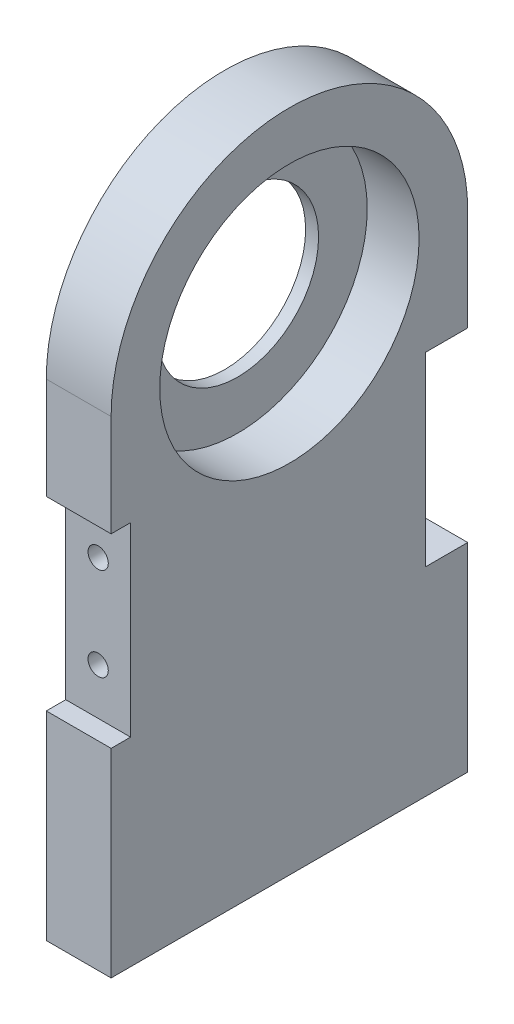
ISO-10303-21;
HEADER;
FILE_DESCRIPTION(('STEP AP214'),'2;1');
FILE_NAME('part.step','',(''),(''),'','','');
FILE_SCHEMA(('AUTOMOTIVE_DESIGN { 1 0 10303 214 1 1 1 1 }'));
ENDSEC;
DATA;
#1=APPLICATION_CONTEXT('core data for automotive mechanical design processes');
#2=APPLICATION_PROTOCOL_DEFINITION('international standard','automotive_design',2000,#1);
#3=PRODUCT_CONTEXT('',#1,'mechanical');
#4=PRODUCT('Part','Part','',(#3));
#5=PRODUCT_RELATED_PRODUCT_CATEGORY('part','',(#4));
#6=PRODUCT_DEFINITION_FORMATION('','',#4);
#7=PRODUCT_DEFINITION_CONTEXT('part definition',#1,'design');
#8=PRODUCT_DEFINITION('design','',#6,#7);
#9=PRODUCT_DEFINITION_SHAPE('','',#8);
#10=(LENGTH_UNIT() NAMED_UNIT(*) SI_UNIT(.MILLI.,.METRE.));
#11=(NAMED_UNIT(*) PLANE_ANGLE_UNIT() SI_UNIT($,.RADIAN.));
#12=(NAMED_UNIT(*) SI_UNIT($,.STERADIAN.) SOLID_ANGLE_UNIT());
#13=UNCERTAINTY_MEASURE_WITH_UNIT(LENGTH_MEASURE(1.E-05),#10,'distance_accuracy_value','');
#14=(GEOMETRIC_REPRESENTATION_CONTEXT(3) GLOBAL_UNCERTAINTY_ASSIGNED_CONTEXT((#13)) GLOBAL_UNIT_ASSIGNED_CONTEXT((#10,
#11,#12)) REPRESENTATION_CONTEXT('',''));
#15=CARTESIAN_POINT('',(0.,0.,0.));
#16=DIRECTION('',(0.,0.,1.));
#17=DIRECTION('',(1.,0.,0.));
#18=AXIS2_PLACEMENT_3D('',#15,#16,#17);
#19=CARTESIAN_POINT('',(20.,0.,-55.));
#20=DIRECTION('',(0.,0.,-1.));
#21=DIRECTION('',(0.,1.,0.));
#22=AXIS2_PLACEMENT_3D('',#19,#20,#21);
#23=PLANE('',#22);
#24=DIRECTION('',(1.,0.,0.));
#25=VECTOR('',#24,1.);
#26=CARTESIAN_POINT('',(0.,-13.65,-55.));
#27=LINE('',#26,#25);
#28=CARTESIAN_POINT('',(0.,-13.65,-55.));
#29=VERTEX_POINT('',#28);
#30=CARTESIAN_POINT('',(20.,-13.65,-55.));
#31=VERTEX_POINT('',#30);
#32=EDGE_CURVE('E246',#29,#31,#27,.T.);
#33=ORIENTED_EDGE('',*,*,#32,.T.);
#34=DIRECTION('',(0.,-1.,0.));
#35=VECTOR('',#34,1.);
#36=CARTESIAN_POINT('',(20.,0.,-55.));
#37=LINE('',#36,#35);
#38=CARTESIAN_POINT('',(20.,-75.,-55.));
#39=VERTEX_POINT('',#38);
#40=EDGE_CURVE('E324',#31,#39,#37,.T.);
#41=ORIENTED_EDGE('',*,*,#40,.T.);
#42=DIRECTION('',(-1.,0.,0.));
#43=VECTOR('',#42,1.);
#44=CARTESIAN_POINT('',(20.,-75.,-55.));
#45=LINE('',#44,#43);
#46=CARTESIAN_POINT('',(0.,-75.,-55.));
#47=VERTEX_POINT('',#46);
#48=EDGE_CURVE('E336',#39,#47,#45,.T.);
#49=ORIENTED_EDGE('',*,*,#48,.T.);
#50=DIRECTION('',(0.,-1.,0.));
#51=VECTOR('',#50,1.);
#52=CARTESIAN_POINT('',(0.,0.,-55.));
#53=LINE('',#52,#51);
#54=EDGE_CURVE('E314',#29,#47,#53,.T.);
#55=ORIENTED_EDGE('',*,*,#54,.F.);
#56=EDGE_LOOP('',(#33,#41,#49,#55));
#57=FACE_BOUND('',#56,.T.);
#58=ADVANCED_FACE('F42',(#57),#23,.T.);
#59=CARTESIAN_POINT('',(20.,0.,55.));
#60=DIRECTION('',(0.,0.,-1.));
#61=DIRECTION('',(0.,1.,0.));
#62=AXIS2_PLACEMENT_3D('',#59,#60,#61);
#63=PLANE('',#62);
#64=DIRECTION('',(0.,-1.,0.));
#65=VECTOR('',#64,1.);
#66=CARTESIAN_POINT('',(20.,0.,55.));
#67=LINE('',#66,#65);
#68=CARTESIAN_POINT('',(20.,-13.65,55.));
#69=VERTEX_POINT('',#68);
#70=CARTESIAN_POINT('',(20.,-75.,55.));
#71=VERTEX_POINT('',#70);
#72=EDGE_CURVE('E327',#69,#71,#67,.T.);
#73=ORIENTED_EDGE('',*,*,#72,.F.);
#74=DIRECTION('',(1.,0.,0.));
#75=VECTOR('',#74,1.);
#76=CARTESIAN_POINT('',(0.,-13.65,55.));
#77=LINE('',#76,#75);
#78=CARTESIAN_POINT('',(0.,-13.65,55.));
#79=VERTEX_POINT('',#78);
#80=EDGE_CURVE('E222',#79,#69,#77,.T.);
#81=ORIENTED_EDGE('',*,*,#80,.F.);
#82=DIRECTION('',(0.,-1.,0.));
#83=VECTOR('',#82,1.);
#84=CARTESIAN_POINT('',(0.,0.,55.));
#85=LINE('',#84,#83);
#86=CARTESIAN_POINT('',(0.,-75.,55.));
#87=VERTEX_POINT('',#86);
#88=EDGE_CURVE('E344',#79,#87,#85,.T.);
#89=ORIENTED_EDGE('',*,*,#88,.T.);
#90=DIRECTION('',(-1.,0.,0.));
#91=VECTOR('',#90,1.);
#92=CARTESIAN_POINT('',(20.,-75.,55.));
#93=LINE('',#92,#91);
#94=EDGE_CURVE('E356',#71,#87,#93,.T.);
#95=ORIENTED_EDGE('',*,*,#94,.F.);
#96=EDGE_LOOP('',(#73,#81,#89,#95));
#97=FACE_BOUND('',#96,.T.);
#98=ADVANCED_FACE('F426',(#97),#63,.F.);
#99=DIRECTION('',(1.,0.,0.));
#100=VECTOR('',#99,1.);
#101=CARTESIAN_POINT('',(0.,43.65,-55.));
#102=LINE('',#101,#100);
#103=CARTESIAN_POINT('',(0.,43.65,-55.));
#104=VERTEX_POINT('',#103);
#105=CARTESIAN_POINT('',(20.,43.65,-55.));
#106=VERTEX_POINT('',#105);
#107=EDGE_CURVE('E261',#104,#106,#102,.T.);
#108=ORIENTED_EDGE('',*,*,#107,.F.);
#109=CARTESIAN_POINT('',(0.,75.,-55.));
#110=VERTEX_POINT('',#109);
#111=EDGE_CURVE('E337',#110,#104,#53,.T.);
#112=ORIENTED_EDGE('',*,*,#111,.F.);
#113=DIRECTION('',(-1.,0.,0.));
#114=VECTOR('',#113,1.);
#115=CARTESIAN_POINT('',(20.,75.,-55.));
#116=LINE('',#115,#114);
#117=CARTESIAN_POINT('',(20.,75.,-55.));
#118=VERTEX_POINT('',#117);
#119=EDGE_CURVE('E11',#118,#110,#116,.T.);
#120=ORIENTED_EDGE('',*,*,#119,.F.);
#121=EDGE_CURVE('E319',#118,#106,#37,.T.);
#122=ORIENTED_EDGE('',*,*,#121,.T.);
#123=EDGE_LOOP('',(#108,#112,#120,#122));
#124=FACE_BOUND('',#123,.T.);
#125=ADVANCED_FACE('F44',(#124),#23,.T.);
#126=CARTESIAN_POINT('',(20.,75.,0.));
#127=DIRECTION('',(-1.,0.,0.));
#128=DIRECTION('',(0.,0.,1.));
#129=AXIS2_PLACEMENT_3D('',#126,#127,#128);
#130=CYLINDRICAL_SURFACE('',#129,55.);
#131=CARTESIAN_POINT('',(0.,75.,0.));
#132=DIRECTION('',(1.,0.,0.));
#133=DIRECTION('',(0.,0.,-1.));
#134=AXIS2_PLACEMENT_3D('',#131,#132,#133);
#135=CIRCLE('',#134,55.);
#136=CARTESIAN_POINT('',(0.,75.,55.));
#137=VERTEX_POINT('',#136);
#138=EDGE_CURVE('E341',#110,#137,#135,.T.);
#139=ORIENTED_EDGE('',*,*,#138,.T.);
#140=DIRECTION('',(-1.,0.,0.));
#141=VECTOR('',#140,1.);
#142=CARTESIAN_POINT('',(20.,75.,55.));
#143=LINE('',#142,#141);
#144=CARTESIAN_POINT('',(20.,75.,55.));
#145=VERTEX_POINT('',#144);
#146=EDGE_CURVE('E52',#145,#137,#143,.T.);
#147=ORIENTED_EDGE('',*,*,#146,.F.);
#148=CARTESIAN_POINT('',(20.,75.,0.));
#149=DIRECTION('',(1.,0.,0.));
#150=DIRECTION('',(0.,0.,-1.));
#151=AXIS2_PLACEMENT_3D('',#148,#149,#150);
#152=CIRCLE('',#151,55.);
#153=EDGE_CURVE('E323',#118,#145,#152,.T.);
#154=ORIENTED_EDGE('',*,*,#153,.F.);
#155=ORIENTED_EDGE('',*,*,#119,.T.);
#156=EDGE_LOOP('',(#139,#147,#154,#155));
#157=FACE_BOUND('',#156,.T.);
#158=ADVANCED_FACE('F387',(#157),#130,.T.);
#159=CARTESIAN_POINT('',(0.,43.65,55.));
#160=VERTEX_POINT('',#159);
#161=EDGE_CURVE('E345',#137,#160,#85,.T.);
#162=ORIENTED_EDGE('',*,*,#161,.T.);
#163=DIRECTION('',(1.,0.,0.));
#164=VECTOR('',#163,1.);
#165=CARTESIAN_POINT('',(0.,43.65,55.));
#166=LINE('',#165,#164);
#167=CARTESIAN_POINT('',(20.,43.65,55.));
#168=VERTEX_POINT('',#167);
#169=EDGE_CURVE('E226',#160,#168,#166,.T.);
#170=ORIENTED_EDGE('',*,*,#169,.T.);
#171=EDGE_CURVE('E328',#145,#168,#67,.T.);
#172=ORIENTED_EDGE('',*,*,#171,.F.);
#173=ORIENTED_EDGE('',*,*,#146,.T.);
#174=EDGE_LOOP('',(#162,#170,#172,#173));
#175=FACE_BOUND('',#174,.T.);
#176=ADVANCED_FACE('F366',(#175),#63,.F.);
#177=CARTESIAN_POINT('',(20.,-75.,0.));
#178=DIRECTION('',(0.,-1.,0.));
#179=DIRECTION('',(0.,0.,-1.));
#180=AXIS2_PLACEMENT_3D('',#177,#178,#179);
#181=PLANE('',#180);
#182=CARTESIAN_POINT('',(10.,-75.,36.6666666666666));
#183=DIRECTION('',(0.,-1.,0.));
#184=DIRECTION('',(0.,0.,-1.));
#185=AXIS2_PLACEMENT_3D('',#182,#183,#184);
#186=CIRCLE('',#185,2.49999999999999);
#187=CARTESIAN_POINT('',(10.,-75.,34.1666666666667));
#188=VERTEX_POINT('',#187);
#189=EDGE_CURVE('E225',#188,#188,#186,.T.);
#190=ORIENTED_EDGE('',*,*,#189,.F.);
#191=EDGE_LOOP('',(#190));
#192=FACE_BOUND('',#191,.T.);
#193=CARTESIAN_POINT('',(10.,-75.,18.3333333333333));
#194=DIRECTION('',(0.,-1.,0.));
#195=DIRECTION('',(0.,0.,-1.));
#196=AXIS2_PLACEMENT_3D('',#193,#194,#195);
#197=CIRCLE('',#196,2.49999999999999);
#198=CARTESIAN_POINT('',(10.,-75.,15.8333333333333));
#199=VERTEX_POINT('',#198);
#200=EDGE_CURVE('E274',#199,#199,#197,.T.);
#201=ORIENTED_EDGE('',*,*,#200,.F.);
#202=EDGE_LOOP('',(#201));
#203=FACE_BOUND('',#202,.T.);
#204=CARTESIAN_POINT('',(10.,-75.,0.));
#205=DIRECTION('',(0.,-1.,0.));
#206=DIRECTION('',(0.,0.,-1.));
#207=AXIS2_PLACEMENT_3D('',#204,#205,#206);
#208=CIRCLE('',#207,2.49999999999999);
#209=CARTESIAN_POINT('',(10.,-75.,-2.50000000000001));
#210=VERTEX_POINT('',#209);
#211=EDGE_CURVE('E282',#210,#210,#208,.T.);
#212=ORIENTED_EDGE('',*,*,#211,.F.);
#213=EDGE_LOOP('',(#212));
#214=FACE_BOUND('',#213,.T.);
#215=CARTESIAN_POINT('',(10.,-75.,-18.3333333333334));
#216=DIRECTION('',(0.,-1.,0.));
#217=DIRECTION('',(0.,0.,-1.));
#218=AXIS2_PLACEMENT_3D('',#215,#216,#217);
#219=CIRCLE('',#218,2.49999999999999);
#220=CARTESIAN_POINT('',(10.,-75.,-20.8333333333333));
#221=VERTEX_POINT('',#220);
#222=EDGE_CURVE('E290',#221,#221,#219,.T.);
#223=ORIENTED_EDGE('',*,*,#222,.F.);
#224=EDGE_LOOP('',(#223));
#225=FACE_BOUND('',#224,.T.);
#226=CARTESIAN_POINT('',(10.,-75.,-36.6666666666667));
#227=DIRECTION('',(0.,-1.,0.));
#228=DIRECTION('',(0.,0.,-1.));
#229=AXIS2_PLACEMENT_3D('',#226,#227,#228);
#230=CIRCLE('',#229,2.49999999999999);
#231=CARTESIAN_POINT('',(10.,-75.,-39.1666666666667));
#232=VERTEX_POINT('',#231);
#233=EDGE_CURVE('E298',#232,#232,#230,.T.);
#234=ORIENTED_EDGE('',*,*,#233,.F.);
#235=EDGE_LOOP('',(#234));
#236=FACE_BOUND('',#235,.T.);
#237=DIRECTION('',(0.,0.,1.));
#238=VECTOR('',#237,1.);
#239=CARTESIAN_POINT('',(0.,-75.,0.));
#240=LINE('',#239,#238);
#241=EDGE_CURVE('E349',#47,#87,#240,.T.);
#242=ORIENTED_EDGE('',*,*,#241,.F.);
#243=ORIENTED_EDGE('',*,*,#48,.F.);
#244=DIRECTION('',(0.,0.,1.));
#245=VECTOR('',#244,1.);
#246=CARTESIAN_POINT('',(20.,-75.,0.));
#247=LINE('',#246,#245);
#248=EDGE_CURVE('E332',#39,#71,#247,.T.);
#249=ORIENTED_EDGE('',*,*,#248,.T.);
#250=ORIENTED_EDGE('',*,*,#94,.T.);
#251=EDGE_LOOP('',(#242,#243,#249,#250));
#252=FACE_BOUND('',#251,.T.);
#253=ADVANCED_FACE('F439',(#192,#203,#214,#225,#236,#252),#181,.T.);
#254=CARTESIAN_POINT('',(20.,0.,0.));
#255=DIRECTION('',(1.,0.,0.));
#256=DIRECTION('',(0.,0.,-1.));
#257=AXIS2_PLACEMENT_3D('',#254,#255,#256);
#258=PLANE('',#257);
#259=DIRECTION('',(0.,0.,-1.));
#260=VECTOR('',#259,1.);
#261=CARTESIAN_POINT('',(20.,-13.65,49.));
#262=LINE('',#261,#260);
#263=CARTESIAN_POINT('',(20.,-13.65,49.));
#264=VERTEX_POINT('',#263);
#265=EDGE_CURVE('E211',#69,#264,#262,.T.);
#266=ORIENTED_EDGE('',*,*,#265,.F.);
#267=ORIENTED_EDGE('',*,*,#72,.T.);
#268=ORIENTED_EDGE('',*,*,#248,.F.);
#269=ORIENTED_EDGE('',*,*,#40,.F.);
#270=DIRECTION('',(0.,0.,-1.));
#271=VECTOR('',#270,1.);
#272=CARTESIAN_POINT('',(20.,-13.65,-42.));
#273=LINE('',#272,#271);
#274=CARTESIAN_POINT('',(20.,-13.65,-42.));
#275=VERTEX_POINT('',#274);
#276=EDGE_CURVE('E198',#275,#31,#273,.T.);
#277=ORIENTED_EDGE('',*,*,#276,.F.);
#278=DIRECTION('',(0.,-1.,0.));
#279=VECTOR('',#278,1.);
#280=CARTESIAN_POINT('',(20.,43.65,-42.));
#281=LINE('',#280,#279);
#282=CARTESIAN_POINT('',(20.,43.65,-42.));
#283=VERTEX_POINT('',#282);
#284=EDGE_CURVE('E240',#283,#275,#281,.T.);
#285=ORIENTED_EDGE('',*,*,#284,.F.);
#286=DIRECTION('',(0.,0.,1.));
#287=VECTOR('',#286,1.);
#288=CARTESIAN_POINT('',(20.,43.65,-55.));
#289=LINE('',#288,#287);
#290=EDGE_CURVE('E249',#106,#283,#289,.T.);
#291=ORIENTED_EDGE('',*,*,#290,.F.);
#292=ORIENTED_EDGE('',*,*,#121,.F.);
#293=ORIENTED_EDGE('',*,*,#153,.T.);
#294=ORIENTED_EDGE('',*,*,#171,.T.);
#295=DIRECTION('',(0.,0.,1.));
#296=VECTOR('',#295,1.);
#297=CARTESIAN_POINT('',(20.,43.65,55.));
#298=LINE('',#297,#296);
#299=CARTESIAN_POINT('',(20.,43.65,49.));
#300=VERTEX_POINT('',#299);
#301=EDGE_CURVE('E204',#300,#168,#298,.T.);
#302=ORIENTED_EDGE('',*,*,#301,.F.);
#303=DIRECTION('',(0.,1.,0.));
#304=VECTOR('',#303,1.);
#305=CARTESIAN_POINT('',(20.,43.65,49.));
#306=LINE('',#305,#304);
#307=EDGE_CURVE('E215',#264,#300,#306,.T.);
#308=ORIENTED_EDGE('',*,*,#307,.F.);
#309=EDGE_LOOP('',(#266,#267,#268,#269,#277,#285,#291,#292,#293,#294,#302,#308));
#310=FACE_BOUND('',#309,.T.);
#311=CARTESIAN_POINT('',(20.,75.,0.));
#312=DIRECTION('',(1.,0.,0.));
#313=DIRECTION('',(0.,0.,-1.));
#314=AXIS2_PLACEMENT_3D('',#311,#312,#313);
#315=CIRCLE('',#314,40.);
#316=CARTESIAN_POINT('',(20.,75.,-40.));
#317=VERTEX_POINT('',#316);
#318=EDGE_CURVE('E315',#317,#317,#315,.T.);
#319=ORIENTED_EDGE('',*,*,#318,.F.);
#320=EDGE_LOOP('',(#319));
#321=FACE_BOUND('',#320,.T.);
#322=ADVANCED_FACE('F383',(#310,#321),#258,.T.);
#323=CARTESIAN_POINT('',(0.,0.,0.));
#324=DIRECTION('',(1.,0.,0.));
#325=DIRECTION('',(0.,0.,-1.));
#326=AXIS2_PLACEMENT_3D('',#323,#324,#325);
#327=PLANE('',#326);
#328=ORIENTED_EDGE('',*,*,#88,.F.);
#329=DIRECTION('',(0.,0.,-1.));
#330=VECTOR('',#329,1.);
#331=CARTESIAN_POINT('',(0.,-13.65,49.));
#332=LINE('',#331,#330);
#333=CARTESIAN_POINT('',(0.,-13.65,49.));
#334=VERTEX_POINT('',#333);
#335=EDGE_CURVE('E199',#79,#334,#332,.T.);
#336=ORIENTED_EDGE('',*,*,#335,.T.);
#337=DIRECTION('',(0.,1.,0.));
#338=VECTOR('',#337,1.);
#339=CARTESIAN_POINT('',(0.,43.65,49.));
#340=LINE('',#339,#338);
#341=CARTESIAN_POINT('',(0.,43.65,49.));
#342=VERTEX_POINT('',#341);
#343=EDGE_CURVE('E203',#334,#342,#340,.T.);
#344=ORIENTED_EDGE('',*,*,#343,.T.);
#345=DIRECTION('',(0.,0.,1.));
#346=VECTOR('',#345,1.);
#347=CARTESIAN_POINT('',(0.,43.65,55.));
#348=LINE('',#347,#346);
#349=EDGE_CURVE('E59',#342,#160,#348,.T.);
#350=ORIENTED_EDGE('',*,*,#349,.T.);
#351=ORIENTED_EDGE('',*,*,#161,.F.);
#352=ORIENTED_EDGE('',*,*,#138,.F.);
#353=ORIENTED_EDGE('',*,*,#111,.T.);
#354=DIRECTION('',(0.,0.,1.));
#355=VECTOR('',#354,1.);
#356=CARTESIAN_POINT('',(0.,43.65,-55.));
#357=LINE('',#356,#355);
#358=CARTESIAN_POINT('',(0.,43.65,-42.));
#359=VERTEX_POINT('',#358);
#360=EDGE_CURVE('E239',#104,#359,#357,.T.);
#361=ORIENTED_EDGE('',*,*,#360,.T.);
#362=DIRECTION('',(0.,-1.,0.));
#363=VECTOR('',#362,1.);
#364=CARTESIAN_POINT('',(0.,43.65,-42.));
#365=LINE('',#364,#363);
#366=CARTESIAN_POINT('',(0.,-13.65,-42.));
#367=VERTEX_POINT('',#366);
#368=EDGE_CURVE('E67',#359,#367,#365,.T.);
#369=ORIENTED_EDGE('',*,*,#368,.T.);
#370=DIRECTION('',(0.,0.,-1.));
#371=VECTOR('',#370,1.);
#372=CARTESIAN_POINT('',(0.,-13.65,-42.));
#373=LINE('',#372,#371);
#374=EDGE_CURVE('E235',#367,#29,#373,.T.);
#375=ORIENTED_EDGE('',*,*,#374,.T.);
#376=ORIENTED_EDGE('',*,*,#54,.T.);
#377=ORIENTED_EDGE('',*,*,#241,.T.);
#378=EDGE_LOOP('',(#328,#336,#344,#350,#351,#352,#353,#361,#369,#375,#376,#377));
#379=FACE_BOUND('',#378,.T.);
#380=CARTESIAN_POINT('',(0.,75.,0.));
#381=DIRECTION('',(1.,0.,0.));
#382=DIRECTION('',(0.,0.,-1.));
#383=AXIS2_PLACEMENT_3D('',#380,#381,#382);
#384=CIRCLE('',#383,25.);
#385=CARTESIAN_POINT('',(0.,75.,-25.));
#386=VERTEX_POINT('',#385);
#387=EDGE_CURVE('E46',#386,#386,#384,.T.);
#388=ORIENTED_EDGE('',*,*,#387,.T.);
#389=EDGE_LOOP('',(#388));
#390=FACE_BOUND('',#389,.T.);
#391=ADVANCED_FACE('F372',(#379,#390),#327,.F.);
#392=CARTESIAN_POINT('',(4.,75.,0.));
#393=DIRECTION('',(1.,0.,0.));
#394=DIRECTION('',(0.,0.,-1.));
#395=AXIS2_PLACEMENT_3D('',#392,#393,#394);
#396=CYLINDRICAL_SURFACE('',#395,40.);
#397=CARTESIAN_POINT('',(4.,75.,0.));
#398=DIRECTION('',(1.,0.,0.));
#399=DIRECTION('',(0.,0.,-1.));
#400=AXIS2_PLACEMENT_3D('',#397,#398,#399);
#401=CIRCLE('',#400,40.);
#402=CARTESIAN_POINT('',(4.,75.,-40.));
#403=VERTEX_POINT('',#402);
#404=EDGE_CURVE('E310',#403,#403,#401,.T.);
#405=ORIENTED_EDGE('',*,*,#404,.F.);
#406=EDGE_LOOP('',(#405));
#407=FACE_BOUND('',#406,.T.);
#408=ORIENTED_EDGE('',*,*,#318,.T.);
#409=EDGE_LOOP('',(#408));
#410=FACE_BOUND('',#409,.T.);
#411=ADVANCED_FACE('F422',(#407,#410),#396,.F.);
#412=CARTESIAN_POINT('',(4.,75.,0.));
#413=DIRECTION('',(1.,0.,0.));
#414=DIRECTION('',(0.,0.,-1.));
#415=AXIS2_PLACEMENT_3D('',#412,#413,#414);
#416=PLANE('',#415);
#417=CARTESIAN_POINT('',(4.,75.,0.));
#418=DIRECTION('',(1.,0.,0.));
#419=DIRECTION('',(0.,0.,-1.));
#420=AXIS2_PLACEMENT_3D('',#417,#418,#419);
#421=CIRCLE('',#420,25.);
#422=CARTESIAN_POINT('',(4.,75.,-25.));
#423=VERTEX_POINT('',#422);
#424=EDGE_CURVE('E306',#423,#423,#421,.T.);
#425=ORIENTED_EDGE('',*,*,#424,.F.);
#426=EDGE_LOOP('',(#425));
#427=FACE_BOUND('',#426,.T.);
#428=ORIENTED_EDGE('',*,*,#404,.T.);
#429=EDGE_LOOP('',(#428));
#430=FACE_BOUND('',#429,.T.);
#431=ADVANCED_FACE('F412',(#427,#430),#416,.T.);
#432=CARTESIAN_POINT('',(-7.1125,75.,0.));
#433=DIRECTION('',(1.,0.,0.));
#434=DIRECTION('',(0.,0.,-1.));
#435=AXIS2_PLACEMENT_3D('',#432,#433,#434);
#436=CYLINDRICAL_SURFACE('',#435,25.);
#437=ORIENTED_EDGE('',*,*,#424,.T.);
#438=EDGE_LOOP('',(#437));
#439=FACE_BOUND('',#438,.T.);
#440=ORIENTED_EDGE('',*,*,#387,.F.);
#441=EDGE_LOOP('',(#440));
#442=FACE_BOUND('',#441,.T.);
#443=ADVANCED_FACE('F409',(#439,#442),#436,.F.);
#444=CARTESIAN_POINT('',(10.,-35.,-36.6666666666667));
#445=DIRECTION('',(0.,-1.,0.));
#446=DIRECTION('',(0.,0.,-1.));
#447=AXIS2_PLACEMENT_3D('',#444,#445,#446);
#448=CONICAL_SURFACE('',#447,2.5,1.02974425867665);
#449=CARTESIAN_POINT('',(9.99999999999999,-33.4978484524311,-36.6666666666667));
#450=VERTEX_POINT('',#449);
#451=VERTEX_LOOP('',#450);
#452=FACE_BOUND('',#451,.T.);
#453=CARTESIAN_POINT('',(10.,-35.,-36.6666666666667));
#454=DIRECTION('',(0.,-1.,0.));
#455=DIRECTION('',(0.,0.,-1.));
#456=AXIS2_PLACEMENT_3D('',#453,#454,#455);
#457=CIRCLE('',#456,2.5);
#458=CARTESIAN_POINT('',(10.,-35.,-39.1666666666667));
#459=VERTEX_POINT('',#458);
#460=EDGE_CURVE('E302',#459,#459,#457,.T.);
#461=ORIENTED_EDGE('',*,*,#460,.T.);
#462=EDGE_LOOP('',(#461));
#463=FACE_BOUND('',#462,.T.);
#464=ADVANCED_FACE('F411',(#452,#463),#448,.F.);
#465=CARTESIAN_POINT('',(10.,-75.,-36.6666666666667));
#466=DIRECTION('',(0.,-1.,0.));
#467=DIRECTION('',(0.,0.,-1.));
#468=AXIS2_PLACEMENT_3D('',#465,#466,#467);
#469=CYLINDRICAL_SURFACE('',#468,2.49999999999999);
#470=ORIENTED_EDGE('',*,*,#460,.F.);
#471=EDGE_LOOP('',(#470));
#472=FACE_BOUND('',#471,.T.);
#473=ORIENTED_EDGE('',*,*,#233,.T.);
#474=EDGE_LOOP('',(#473));
#475=FACE_BOUND('',#474,.T.);
#476=ADVANCED_FACE('F419',(#472,#475),#469,.F.);
#477=CARTESIAN_POINT('',(10.,-35.,-18.3333333333334));
#478=DIRECTION('',(0.,-1.,0.));
#479=DIRECTION('',(0.,0.,-1.));
#480=AXIS2_PLACEMENT_3D('',#477,#478,#479);
#481=CONICAL_SURFACE('',#480,2.5,1.02974425867665);
#482=CARTESIAN_POINT('',(9.99999999999999,-33.4978484524311,-18.3333333333334));
#483=VERTEX_POINT('',#482);
#484=VERTEX_LOOP('',#483);
#485=FACE_BOUND('',#484,.T.);
#486=CARTESIAN_POINT('',(10.,-35.,-18.3333333333334));
#487=DIRECTION('',(0.,-1.,0.));
#488=DIRECTION('',(0.,0.,-1.));
#489=AXIS2_PLACEMENT_3D('',#486,#487,#488);
#490=CIRCLE('',#489,2.5);
#491=CARTESIAN_POINT('',(10.,-35.,-20.8333333333333));
#492=VERTEX_POINT('',#491);
#493=EDGE_CURVE('E294',#492,#492,#490,.T.);
#494=ORIENTED_EDGE('',*,*,#493,.T.);
#495=EDGE_LOOP('',(#494));
#496=FACE_BOUND('',#495,.T.);
#497=ADVANCED_FACE('F489',(#485,#496),#481,.F.);
#498=CARTESIAN_POINT('',(10.,-75.,-18.3333333333334));
#499=DIRECTION('',(0.,-1.,0.));
#500=DIRECTION('',(0.,0.,-1.));
#501=AXIS2_PLACEMENT_3D('',#498,#499,#500);
#502=CYLINDRICAL_SURFACE('',#501,2.49999999999999);
#503=ORIENTED_EDGE('',*,*,#493,.F.);
#504=EDGE_LOOP('',(#503));
#505=FACE_BOUND('',#504,.T.);
#506=ORIENTED_EDGE('',*,*,#222,.T.);
#507=EDGE_LOOP('',(#506));
#508=FACE_BOUND('',#507,.T.);
#509=ADVANCED_FACE('F499',(#505,#508),#502,.F.);
#510=CARTESIAN_POINT('',(10.,-35.,0.));
#511=DIRECTION('',(0.,-1.,0.));
#512=DIRECTION('',(0.,0.,-1.));
#513=AXIS2_PLACEMENT_3D('',#510,#511,#512);
#514=CONICAL_SURFACE('',#513,2.5,1.02974425867665);
#515=CARTESIAN_POINT('',(9.99999999999999,-33.4978484524311,0.));
#516=VERTEX_POINT('',#515);
#517=VERTEX_LOOP('',#516);
#518=FACE_BOUND('',#517,.T.);
#519=CARTESIAN_POINT('',(10.,-35.,0.));
#520=DIRECTION('',(0.,-1.,0.));
#521=DIRECTION('',(0.,0.,-1.));
#522=AXIS2_PLACEMENT_3D('',#519,#520,#521);
#523=CIRCLE('',#522,2.5);
#524=CARTESIAN_POINT('',(10.,-35.,-2.50000000000002));
#525=VERTEX_POINT('',#524);
#526=EDGE_CURVE('E286',#525,#525,#523,.T.);
#527=ORIENTED_EDGE('',*,*,#526,.T.);
#528=EDGE_LOOP('',(#527));
#529=FACE_BOUND('',#528,.T.);
#530=ADVANCED_FACE('F509',(#518,#529),#514,.F.);
#531=CARTESIAN_POINT('',(10.,-75.,0.));
#532=DIRECTION('',(0.,-1.,0.));
#533=DIRECTION('',(0.,0.,-1.));
#534=AXIS2_PLACEMENT_3D('',#531,#532,#533);
#535=CYLINDRICAL_SURFACE('',#534,2.49999999999999);
#536=ORIENTED_EDGE('',*,*,#526,.F.);
#537=EDGE_LOOP('',(#536));
#538=FACE_BOUND('',#537,.T.);
#539=ORIENTED_EDGE('',*,*,#211,.T.);
#540=EDGE_LOOP('',(#539));
#541=FACE_BOUND('',#540,.T.);
#542=ADVANCED_FACE('F519',(#538,#541),#535,.F.);
#543=CARTESIAN_POINT('',(10.,-35.,18.3333333333333));
#544=DIRECTION('',(0.,-1.,0.));
#545=DIRECTION('',(0.,0.,-1.));
#546=AXIS2_PLACEMENT_3D('',#543,#544,#545);
#547=CONICAL_SURFACE('',#546,2.5,1.02974425867665);
#548=CARTESIAN_POINT('',(9.99999999999999,-33.4978484524311,18.3333333333333));
#549=VERTEX_POINT('',#548);
#550=VERTEX_LOOP('',#549);
#551=FACE_BOUND('',#550,.T.);
#552=CARTESIAN_POINT('',(10.,-35.,18.3333333333333));
#553=DIRECTION('',(0.,-1.,0.));
#554=DIRECTION('',(0.,0.,-1.));
#555=AXIS2_PLACEMENT_3D('',#552,#553,#554);
#556=CIRCLE('',#555,2.5);
#557=CARTESIAN_POINT('',(10.,-35.,15.8333333333333));
#558=VERTEX_POINT('',#557);
#559=EDGE_CURVE('E278',#558,#558,#556,.T.);
#560=ORIENTED_EDGE('',*,*,#559,.T.);
#561=EDGE_LOOP('',(#560));
#562=FACE_BOUND('',#561,.T.);
#563=ADVANCED_FACE('F529',(#551,#562),#547,.F.);
#564=CARTESIAN_POINT('',(10.,-75.,18.3333333333333));
#565=DIRECTION('',(0.,-1.,0.));
#566=DIRECTION('',(0.,0.,-1.));
#567=AXIS2_PLACEMENT_3D('',#564,#565,#566);
#568=CYLINDRICAL_SURFACE('',#567,2.49999999999999);
#569=ORIENTED_EDGE('',*,*,#559,.F.);
#570=EDGE_LOOP('',(#569));
#571=FACE_BOUND('',#570,.T.);
#572=ORIENTED_EDGE('',*,*,#200,.T.);
#573=EDGE_LOOP('',(#572));
#574=FACE_BOUND('',#573,.T.);
#575=ADVANCED_FACE('F539',(#571,#574),#568,.F.);
#576=CARTESIAN_POINT('',(10.,-35.,36.6666666666666));
#577=DIRECTION('',(0.,-1.,0.));
#578=DIRECTION('',(0.,0.,-1.));
#579=AXIS2_PLACEMENT_3D('',#576,#577,#578);
#580=CONICAL_SURFACE('',#579,2.5,1.02974425867665);
#581=CARTESIAN_POINT('',(9.99999999999999,-33.4978484524311,36.6666666666666));
#582=VERTEX_POINT('',#581);
#583=VERTEX_LOOP('',#582);
#584=FACE_BOUND('',#583,.T.);
#585=CARTESIAN_POINT('',(10.,-35.,36.6666666666666));
#586=DIRECTION('',(0.,-1.,0.));
#587=DIRECTION('',(0.,0.,-1.));
#588=AXIS2_PLACEMENT_3D('',#585,#586,#587);
#589=CIRCLE('',#588,2.5);
#590=CARTESIAN_POINT('',(10.,-35.,34.1666666666667));
#591=VERTEX_POINT('',#590);
#592=EDGE_CURVE('E270',#591,#591,#589,.T.);
#593=ORIENTED_EDGE('',*,*,#592,.T.);
#594=EDGE_LOOP('',(#593));
#595=FACE_BOUND('',#594,.T.);
#596=ADVANCED_FACE('F549',(#584,#595),#580,.F.);
#597=CARTESIAN_POINT('',(10.,-75.,36.6666666666666));
#598=DIRECTION('',(0.,-1.,0.));
#599=DIRECTION('',(0.,0.,-1.));
#600=AXIS2_PLACEMENT_3D('',#597,#598,#599);
#601=CYLINDRICAL_SURFACE('',#600,2.49999999999999);
#602=ORIENTED_EDGE('',*,*,#592,.F.);
#603=EDGE_LOOP('',(#602));
#604=FACE_BOUND('',#603,.T.);
#605=ORIENTED_EDGE('',*,*,#189,.T.);
#606=EDGE_LOOP('',(#605));
#607=FACE_BOUND('',#606,.T.);
#608=ADVANCED_FACE('F559',(#604,#607),#601,.F.);
#609=CARTESIAN_POINT('',(0.,-13.65,-42.));
#610=DIRECTION('',(0.,-1.,0.));
#611=DIRECTION('',(0.,0.,-1.));
#612=AXIS2_PLACEMENT_3D('',#609,#610,#611);
#613=PLANE('',#612);
#614=ORIENTED_EDGE('',*,*,#276,.T.);
#615=ORIENTED_EDGE('',*,*,#32,.F.);
#616=ORIENTED_EDGE('',*,*,#374,.F.);
#617=DIRECTION('',(1.,0.,0.));
#618=VECTOR('',#617,1.);
#619=CARTESIAN_POINT('',(0.,-13.65,-42.));
#620=LINE('',#619,#618);
#621=EDGE_CURVE('E216',#367,#275,#620,.T.);
#622=ORIENTED_EDGE('',*,*,#621,.T.);
#623=EDGE_LOOP('',(#614,#615,#616,#622));
#624=FACE_BOUND('',#623,.T.);
#625=ADVANCED_FACE('F399',(#624),#613,.F.);
#626=CARTESIAN_POINT('',(0.,43.65,-42.));
#627=DIRECTION('',(0.,0.,1.));
#628=DIRECTION('',(1.,0.,0.));
#629=AXIS2_PLACEMENT_3D('',#626,#627,#628);
#630=PLANE('',#629);
#631=CARTESIAN_POINT('',(10.,29.325,-42.));
#632=DIRECTION('',(0.,0.,-1.));
#633=DIRECTION('',(-1.,0.,0.));
#634=AXIS2_PLACEMENT_3D('',#631,#632,#633);
#635=CIRCLE('',#634,3.12499999999999);
#636=CARTESIAN_POINT('',(6.87500000000001,29.325,-42.));
#637=VERTEX_POINT('',#636);
#638=EDGE_CURVE('E169',#637,#637,#635,.T.);
#639=ORIENTED_EDGE('',*,*,#638,.F.);
#640=EDGE_LOOP('',(#639));
#641=FACE_BOUND('',#640,.T.);
#642=CARTESIAN_POINT('',(10.,0.674999999999995,-42.));
#643=DIRECTION('',(0.,0.,-1.));
#644=DIRECTION('',(-1.,0.,0.));
#645=AXIS2_PLACEMENT_3D('',#642,#643,#644);
#646=CIRCLE('',#645,3.12499999999999);
#647=CARTESIAN_POINT('',(6.87500000000001,0.674999999999995,-42.));
#648=VERTEX_POINT('',#647);
#649=EDGE_CURVE('E168',#648,#648,#646,.T.);
#650=ORIENTED_EDGE('',*,*,#649,.F.);
#651=EDGE_LOOP('',(#650));
#652=FACE_BOUND('',#651,.T.);
#653=ORIENTED_EDGE('',*,*,#284,.T.);
#654=ORIENTED_EDGE('',*,*,#621,.F.);
#655=ORIENTED_EDGE('',*,*,#368,.F.);
#656=DIRECTION('',(1.,0.,0.));
#657=VECTOR('',#656,1.);
#658=CARTESIAN_POINT('',(0.,43.65,-42.));
#659=LINE('',#658,#657);
#660=EDGE_CURVE('E258',#359,#283,#659,.T.);
#661=ORIENTED_EDGE('',*,*,#660,.T.);
#662=EDGE_LOOP('',(#653,#654,#655,#661));
#663=FACE_BOUND('',#662,.T.);
#664=ADVANCED_FACE('F393',(#641,#652,#663),#630,.F.);
#665=CARTESIAN_POINT('',(0.,43.65,-55.));
#666=DIRECTION('',(0.,1.,0.));
#667=DIRECTION('',(0.,0.,1.));
#668=AXIS2_PLACEMENT_3D('',#665,#666,#667);
#669=PLANE('',#668);
#670=ORIENTED_EDGE('',*,*,#290,.T.);
#671=ORIENTED_EDGE('',*,*,#660,.F.);
#672=ORIENTED_EDGE('',*,*,#360,.F.);
#673=ORIENTED_EDGE('',*,*,#107,.T.);
#674=EDGE_LOOP('',(#670,#671,#672,#673));
#675=FACE_BOUND('',#674,.T.);
#676=ADVANCED_FACE('F391',(#675),#669,.F.);
#677=CARTESIAN_POINT('',(0.,-13.65,49.));
#678=DIRECTION('',(0.,-1.,0.));
#679=DIRECTION('',(0.,0.,-1.));
#680=AXIS2_PLACEMENT_3D('',#677,#678,#679);
#681=PLANE('',#680);
#682=ORIENTED_EDGE('',*,*,#265,.T.);
#683=DIRECTION('',(1.,0.,0.));
#684=VECTOR('',#683,1.);
#685=CARTESIAN_POINT('',(0.,-13.65,49.));
#686=LINE('',#685,#684);
#687=EDGE_CURVE('E210',#334,#264,#686,.T.);
#688=ORIENTED_EDGE('',*,*,#687,.F.);
#689=ORIENTED_EDGE('',*,*,#335,.F.);
#690=ORIENTED_EDGE('',*,*,#80,.T.);
#691=EDGE_LOOP('',(#682,#688,#689,#690));
#692=FACE_BOUND('',#691,.T.);
#693=ADVANCED_FACE('F619',(#692),#681,.F.);
#694=CARTESIAN_POINT('',(0.,43.65,55.));
#695=DIRECTION('',(0.,1.,0.));
#696=DIRECTION('',(0.,0.,1.));
#697=AXIS2_PLACEMENT_3D('',#694,#695,#696);
#698=PLANE('',#697);
#699=ORIENTED_EDGE('',*,*,#301,.T.);
#700=ORIENTED_EDGE('',*,*,#169,.F.);
#701=ORIENTED_EDGE('',*,*,#349,.F.);
#702=DIRECTION('',(1.,0.,0.));
#703=VECTOR('',#702,1.);
#704=CARTESIAN_POINT('',(0.,43.65,49.));
#705=LINE('',#704,#703);
#706=EDGE_CURVE('E230',#342,#300,#705,.T.);
#707=ORIENTED_EDGE('',*,*,#706,.T.);
#708=EDGE_LOOP('',(#699,#700,#701,#707));
#709=FACE_BOUND('',#708,.T.);
#710=ADVANCED_FACE('F380',(#709),#698,.F.);
#711=CARTESIAN_POINT('',(0.,43.65,49.));
#712=DIRECTION('',(0.,0.,-1.));
#713=DIRECTION('',(-1.,0.,0.));
#714=AXIS2_PLACEMENT_3D('',#711,#712,#713);
#715=PLANE('',#714);
#716=CARTESIAN_POINT('',(10.,29.325,49.));
#717=DIRECTION('',(0.,0.,1.));
#718=DIRECTION('',(1.,0.,0.));
#719=AXIS2_PLACEMENT_3D('',#716,#717,#718);
#720=CIRCLE('',#719,3.12499999999999);
#721=CARTESIAN_POINT('',(13.125,29.325,49.));
#722=VERTEX_POINT('',#721);
#723=EDGE_CURVE('E182',#722,#722,#720,.T.);
#724=ORIENTED_EDGE('',*,*,#723,.F.);
#725=EDGE_LOOP('',(#724));
#726=FACE_BOUND('',#725,.T.);
#727=CARTESIAN_POINT('',(10.,0.675000000000002,49.));
#728=DIRECTION('',(0.,0.,1.));
#729=DIRECTION('',(1.,0.,0.));
#730=AXIS2_PLACEMENT_3D('',#727,#728,#729);
#731=CIRCLE('',#730,3.12499999999999);
#732=CARTESIAN_POINT('',(13.125,0.675000000000002,49.));
#733=VERTEX_POINT('',#732);
#734=EDGE_CURVE('E190',#733,#733,#731,.T.);
#735=ORIENTED_EDGE('',*,*,#734,.F.);
#736=EDGE_LOOP('',(#735));
#737=FACE_BOUND('',#736,.T.);
#738=ORIENTED_EDGE('',*,*,#307,.T.);
#739=ORIENTED_EDGE('',*,*,#706,.F.);
#740=ORIENTED_EDGE('',*,*,#343,.F.);
#741=ORIENTED_EDGE('',*,*,#687,.T.);
#742=EDGE_LOOP('',(#738,#739,#740,#741));
#743=FACE_BOUND('',#742,.T.);
#744=ADVANCED_FACE('F377',(#726,#737,#743),#715,.F.);
#745=CARTESIAN_POINT('',(10.,0.675000000000002,29.));
#746=DIRECTION('',(0.,0.,1.));
#747=DIRECTION('',(1.,0.,0.));
#748=AXIS2_PLACEMENT_3D('',#745,#746,#747);
#749=CONICAL_SURFACE('',#748,3.12499999999999,1.02974425867665);
#750=CARTESIAN_POINT('',(9.99999999999999,0.675000000000002,27.1223105655389));
#751=VERTEX_POINT('',#750);
#752=VERTEX_LOOP('',#751);
#753=FACE_BOUND('',#752,.T.);
#754=CARTESIAN_POINT('',(10.,0.675000000000002,29.));
#755=DIRECTION('',(0.,0.,1.));
#756=DIRECTION('',(1.,0.,0.));
#757=AXIS2_PLACEMENT_3D('',#754,#755,#756);
#758=CIRCLE('',#757,3.12499999999999);
#759=CARTESIAN_POINT('',(13.125,0.675000000000002,29.));
#760=VERTEX_POINT('',#759);
#761=EDGE_CURVE('E194',#760,#760,#758,.T.);
#762=ORIENTED_EDGE('',*,*,#761,.T.);
#763=EDGE_LOOP('',(#762));
#764=FACE_BOUND('',#763,.T.);
#765=ADVANCED_FACE('F645',(#753,#764),#749,.F.);
#766=CARTESIAN_POINT('',(10.,0.675000000000002,49.));
#767=DIRECTION('',(0.,0.,1.));
#768=DIRECTION('',(1.,0.,0.));
#769=AXIS2_PLACEMENT_3D('',#766,#767,#768);
#770=CYLINDRICAL_SURFACE('',#769,3.12499999999999);
#771=ORIENTED_EDGE('',*,*,#761,.F.);
#772=EDGE_LOOP('',(#771));
#773=FACE_BOUND('',#772,.T.);
#774=ORIENTED_EDGE('',*,*,#734,.T.);
#775=EDGE_LOOP('',(#774));
#776=FACE_BOUND('',#775,.T.);
#777=ADVANCED_FACE('F655',(#773,#776),#770,.F.);
#778=CARTESIAN_POINT('',(10.,29.325,29.));
#779=DIRECTION('',(0.,0.,1.));
#780=DIRECTION('',(1.,0.,0.));
#781=AXIS2_PLACEMENT_3D('',#778,#779,#780);
#782=CONICAL_SURFACE('',#781,3.12499999999999,1.02974425867665);
#783=CARTESIAN_POINT('',(9.99999999999999,29.325,27.1223105655389));
#784=VERTEX_POINT('',#783);
#785=VERTEX_LOOP('',#784);
#786=FACE_BOUND('',#785,.T.);
#787=CARTESIAN_POINT('',(10.,29.325,29.));
#788=DIRECTION('',(0.,0.,1.));
#789=DIRECTION('',(1.,0.,0.));
#790=AXIS2_PLACEMENT_3D('',#787,#788,#789);
#791=CIRCLE('',#790,3.12499999999999);
#792=CARTESIAN_POINT('',(13.125,29.325,29.));
#793=VERTEX_POINT('',#792);
#794=EDGE_CURVE('E186',#793,#793,#791,.T.);
#795=ORIENTED_EDGE('',*,*,#794,.T.);
#796=EDGE_LOOP('',(#795));
#797=FACE_BOUND('',#796,.T.);
#798=ADVANCED_FACE('F665',(#786,#797),#782,.F.);
#799=CARTESIAN_POINT('',(10.,29.325,49.));
#800=DIRECTION('',(0.,0.,1.));
#801=DIRECTION('',(1.,0.,0.));
#802=AXIS2_PLACEMENT_3D('',#799,#800,#801);
#803=CYLINDRICAL_SURFACE('',#802,3.12499999999999);
#804=ORIENTED_EDGE('',*,*,#794,.F.);
#805=EDGE_LOOP('',(#804));
#806=FACE_BOUND('',#805,.T.);
#807=ORIENTED_EDGE('',*,*,#723,.T.);
#808=EDGE_LOOP('',(#807));
#809=FACE_BOUND('',#808,.T.);
#810=ADVANCED_FACE('F675',(#806,#809),#803,.F.);
#811=CARTESIAN_POINT('',(10.,0.674999999999995,-22.));
#812=DIRECTION('',(0.,0.,-1.));
#813=DIRECTION('',(-1.,0.,0.));
#814=AXIS2_PLACEMENT_3D('',#811,#812,#813);
#815=CONICAL_SURFACE('',#814,3.12499999999999,1.02974425867665);
#816=CARTESIAN_POINT('',(9.99999999999999,0.674999999999995,-20.1223105655389));
#817=VERTEX_POINT('',#816);
#818=VERTEX_LOOP('',#817);
#819=FACE_BOUND('',#818,.T.);
#820=CARTESIAN_POINT('',(10.,0.674999999999995,-22.));
#821=DIRECTION('',(0.,0.,-1.));
#822=DIRECTION('',(-1.,0.,0.));
#823=AXIS2_PLACEMENT_3D('',#820,#821,#822);
#824=CIRCLE('',#823,3.12499999999999);
#825=CARTESIAN_POINT('',(6.87500000000001,0.674999999999995,-22.));
#826=VERTEX_POINT('',#825);
#827=EDGE_CURVE('E174',#826,#826,#824,.T.);
#828=ORIENTED_EDGE('',*,*,#827,.T.);
#829=EDGE_LOOP('',(#828));
#830=FACE_BOUND('',#829,.T.);
#831=ADVANCED_FACE('F685',(#819,#830),#815,.F.);
#832=CARTESIAN_POINT('',(10.,0.674999999999995,-42.));
#833=DIRECTION('',(0.,0.,-1.));
#834=DIRECTION('',(-1.,0.,0.));
#835=AXIS2_PLACEMENT_3D('',#832,#833,#834);
#836=CYLINDRICAL_SURFACE('',#835,3.12499999999999);
#837=ORIENTED_EDGE('',*,*,#827,.F.);
#838=EDGE_LOOP('',(#837));
#839=FACE_BOUND('',#838,.T.);
#840=ORIENTED_EDGE('',*,*,#649,.T.);
#841=EDGE_LOOP('',(#840));
#842=FACE_BOUND('',#841,.T.);
#843=ADVANCED_FACE('F161',(#839,#842),#836,.F.);
#844=CARTESIAN_POINT('',(10.,29.325,-22.));
#845=DIRECTION('',(0.,0.,-1.));
#846=DIRECTION('',(-1.,0.,0.));
#847=AXIS2_PLACEMENT_3D('',#844,#845,#846);
#848=CONICAL_SURFACE('',#847,3.12499999999999,1.02974425867665);
#849=CARTESIAN_POINT('',(9.99999999999999,29.325,-20.1223105655389));
#850=VERTEX_POINT('',#849);
#851=VERTEX_LOOP('',#850);
#852=FACE_BOUND('',#851,.T.);
#853=CARTESIAN_POINT('',(10.,29.325,-22.));
#854=DIRECTION('',(0.,0.,-1.));
#855=DIRECTION('',(-1.,0.,0.));
#856=AXIS2_PLACEMENT_3D('',#853,#854,#855);
#857=CIRCLE('',#856,3.12499999999999);
#858=CARTESIAN_POINT('',(6.87500000000001,29.325,-22.));
#859=VERTEX_POINT('',#858);
#860=EDGE_CURVE('E165',#859,#859,#857,.T.);
#861=ORIENTED_EDGE('',*,*,#860,.T.);
#862=EDGE_LOOP('',(#861));
#863=FACE_BOUND('',#862,.T.);
#864=ADVANCED_FACE('F157',(#852,#863),#848,.F.);
#865=CARTESIAN_POINT('',(10.,29.325,-42.));
#866=DIRECTION('',(0.,0.,-1.));
#867=DIRECTION('',(-1.,0.,0.));
#868=AXIS2_PLACEMENT_3D('',#865,#866,#867);
#869=CYLINDRICAL_SURFACE('',#868,3.12499999999999);
#870=ORIENTED_EDGE('',*,*,#860,.F.);
#871=EDGE_LOOP('',(#870));
#872=FACE_BOUND('',#871,.T.);
#873=ORIENTED_EDGE('',*,*,#638,.T.);
#874=EDGE_LOOP('',(#873));
#875=FACE_BOUND('',#874,.T.);
#876=ADVANCED_FACE('F160',(#872,#875),#869,.F.);
#877=CLOSED_SHELL('',(#58,#98,#125,#158,#176,#253,#322,#391,#411,#431,#443,#464,#476,#497,#509,
#530,#542,#563,#575,#596,#608,#625,#664,#676,#693,#710,#744,#765,#777,#798,#810,#831,#843,#864,#876));
#878=MANIFOLD_SOLID_BREP('B2',#877);
#879=ADVANCED_BREP_SHAPE_REPRESENTATION('',(#18,#878),#14);
#880=SHAPE_DEFINITION_REPRESENTATION(#9,#879);
ENDSEC;
END-ISO-10303-21;
